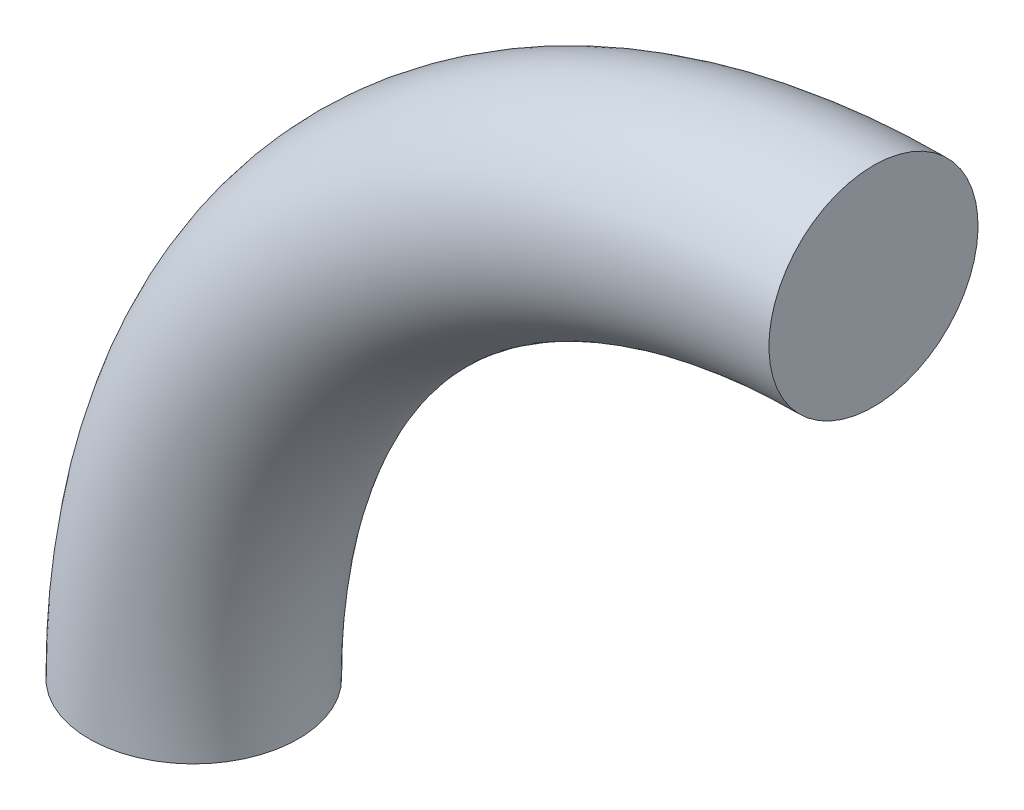
ISO-10303-21;
HEADER;
FILE_DESCRIPTION(('STEP AP214'),'2;1');
FILE_NAME('part.step','',(''),(''),'','','');
FILE_SCHEMA(('AUTOMOTIVE_DESIGN { 1 0 10303 214 1 1 1 1 }'));
ENDSEC;
DATA;
#1=APPLICATION_CONTEXT('core data for automotive mechanical design processes');
#2=APPLICATION_PROTOCOL_DEFINITION('international standard','automotive_design',2000,#1);
#3=PRODUCT_CONTEXT('',#1,'mechanical');
#4=PRODUCT('Part','Part','',(#3));
#5=PRODUCT_RELATED_PRODUCT_CATEGORY('part','',(#4));
#6=PRODUCT_DEFINITION_FORMATION('','',#4);
#7=PRODUCT_DEFINITION_CONTEXT('part definition',#1,'design');
#8=PRODUCT_DEFINITION('design','',#6,#7);
#9=PRODUCT_DEFINITION_SHAPE('','',#8);
#10=(LENGTH_UNIT() NAMED_UNIT(*) SI_UNIT(.MILLI.,.METRE.));
#11=(NAMED_UNIT(*) PLANE_ANGLE_UNIT() SI_UNIT($,.RADIAN.));
#12=(NAMED_UNIT(*) SI_UNIT($,.STERADIAN.) SOLID_ANGLE_UNIT());
#13=UNCERTAINTY_MEASURE_WITH_UNIT(LENGTH_MEASURE(1.E-05),#10,'distance_accuracy_value','');
#14=(GEOMETRIC_REPRESENTATION_CONTEXT(3) GLOBAL_UNCERTAINTY_ASSIGNED_CONTEXT((#13)) GLOBAL_UNIT_ASSIGNED_CONTEXT((#10,
#11,#12)) REPRESENTATION_CONTEXT('',''));
#15=CARTESIAN_POINT('',(0.,0.,0.));
#16=DIRECTION('',(0.,0.,1.));
#17=DIRECTION('',(1.,0.,0.));
#18=AXIS2_PLACEMENT_3D('',#15,#16,#17);
#19=CARTESIAN_POINT('',(0.,0.,0.));
#20=DIRECTION('',(0.,1.,0.));
#21=DIRECTION('',(0.,0.,1.));
#22=AXIS2_PLACEMENT_3D('',#19,#20,#21);
#23=PLANE('',#22);
#24=CARTESIAN_POINT('',(0.,0.,0.));
#25=DIRECTION('',(0.,1.,0.));
#26=DIRECTION('',(0.,0.,1.));
#27=AXIS2_PLACEMENT_3D('',#24,#25,#26);
#28=CIRCLE('',#27,10.);
#29=CARTESIAN_POINT('',(-9.99999999999999,0.,0.));
#30=VERTEX_POINT('',#29);
#31=EDGE_CURVE('E37',#30,#30,#28,.T.);
#32=ORIENTED_EDGE('',*,*,#31,.F.);
#33=EDGE_LOOP('',(#32));
#34=FACE_BOUND('',#33,.T.);
#35=ADVANCED_FACE('F31',(#34),#23,.F.);
#36=CARTESIAN_POINT('',(65.,65.,0.));
#37=DIRECTION('',(1.,0.,0.));
#38=DIRECTION('',(0.,0.,1.));
#39=AXIS2_PLACEMENT_3D('',#36,#37,#38);
#40=PLANE('',#39);
#41=CARTESIAN_POINT('',(65.,65.,0.));
#42=DIRECTION('',(1.,0.,0.));
#43=DIRECTION('',(0.,0.,1.));
#44=AXIS2_PLACEMENT_3D('',#41,#42,#43);
#45=CIRCLE('',#44,10.);
#46=CARTESIAN_POINT('',(65.,75.,0.));
#47=VERTEX_POINT('',#46);
#48=EDGE_CURVE('E10',#47,#47,#45,.T.);
#49=ORIENTED_EDGE('',*,*,#48,.T.);
#50=EDGE_LOOP('',(#49));
#51=FACE_BOUND('',#50,.T.);
#52=ADVANCED_FACE('F46',(#51),#40,.T.);
#53=CARTESIAN_POINT('',(65.,0.,0.));
#54=DIRECTION('',(0.,0.,-1.));
#55=DIRECTION('',(-1.,0.,0.));
#56=AXIS2_PLACEMENT_3D('',#53,#54,#55);
#57=TOROIDAL_SURFACE('',#56,65.,10.);
#58=CARTESIAN_POINT('',(65.,0.,0.));
#59=DIRECTION('',(0.,0.,-1.));
#60=DIRECTION('',(-1.,0.,0.));
#61=AXIS2_PLACEMENT_3D('',#58,#59,#60);
#62=CIRCLE('',#61,75.);
#63=EDGE_CURVE('',#30,#47,#62,.T.);
#64=ORIENTED_EDGE('',*,*,#31,.T.);
#65=ORIENTED_EDGE('',*,*,#48,.F.);
#66=ORIENTED_EDGE('',*,*,#63,.T.);
#67=ORIENTED_EDGE('',*,*,#63,.F.);
#68=EDGE_LOOP('',(#64,#66,#65,#67));
#69=FACE_BOUND('',#68,.T.);
#70=ADVANCED_FACE('F43',(#69),#57,.T.);
#71=CLOSED_SHELL('',(#35,#52,#70));
#72=MANIFOLD_SOLID_BREP('B2',#71);
#73=ADVANCED_BREP_SHAPE_REPRESENTATION('',(#18,#72),#14);
#74=SHAPE_DEFINITION_REPRESENTATION(#9,#73);
ENDSEC;
END-ISO-10303-21;
